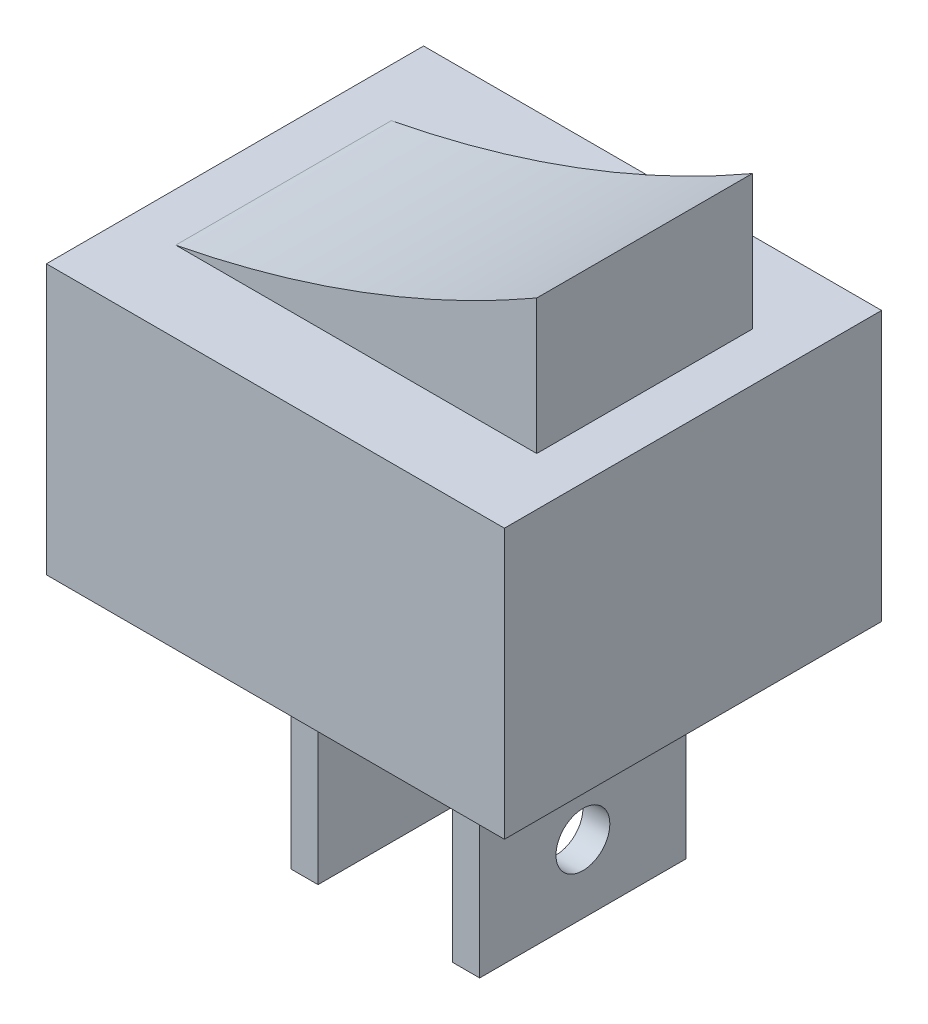
ISO-10303-21;
HEADER;
FILE_DESCRIPTION(('STEP AP214'),'2;1');
FILE_NAME('part.step','',(''),(''),'','','');
FILE_SCHEMA(('AUTOMOTIVE_DESIGN { 1 0 10303 214 1 1 1 1 }'));
ENDSEC;
DATA;
#1=APPLICATION_CONTEXT('core data for automotive mechanical design processes');
#2=APPLICATION_PROTOCOL_DEFINITION('international standard','automotive_design',2000,#1);
#3=PRODUCT_CONTEXT('',#1,'mechanical');
#4=PRODUCT('Part','Part','',(#3));
#5=PRODUCT_RELATED_PRODUCT_CATEGORY('part','',(#4));
#6=PRODUCT_DEFINITION_FORMATION('','',#4);
#7=PRODUCT_DEFINITION_CONTEXT('part definition',#1,'design');
#8=PRODUCT_DEFINITION('design','',#6,#7);
#9=PRODUCT_DEFINITION_SHAPE('','',#8);
#10=(LENGTH_UNIT() NAMED_UNIT(*) SI_UNIT(.MILLI.,.METRE.));
#11=(NAMED_UNIT(*) PLANE_ANGLE_UNIT() SI_UNIT($,.RADIAN.));
#12=(NAMED_UNIT(*) SI_UNIT($,.STERADIAN.) SOLID_ANGLE_UNIT());
#13=UNCERTAINTY_MEASURE_WITH_UNIT(LENGTH_MEASURE(1.E-05),#10,'distance_accuracy_value','');
#14=(GEOMETRIC_REPRESENTATION_CONTEXT(3) GLOBAL_UNCERTAINTY_ASSIGNED_CONTEXT((#13)) GLOBAL_UNIT_ASSIGNED_CONTEXT((#10,
#11,#12)) REPRESENTATION_CONTEXT('',''));
#15=CARTESIAN_POINT('',(0.,0.,0.));
#16=DIRECTION('',(0.,0.,1.));
#17=DIRECTION('',(1.,0.,0.));
#18=AXIS2_PLACEMENT_3D('',#15,#16,#17);
#19=CARTESIAN_POINT('',(0.,0.,0.));
#20=DIRECTION('',(0.,-1.,0.));
#21=DIRECTION('',(0.,0.,-1.));
#22=AXIS2_PLACEMENT_3D('',#19,#20,#21);
#23=PLANE('',#22);
#24=DIRECTION('',(0.,0.,1.));
#25=VECTOR('',#24,1.);
#26=CARTESIAN_POINT('',(0.,0.,0.));
#27=LINE('',#26,#25);
#28=CARTESIAN_POINT('',(0.,0.,-14.));
#29=VERTEX_POINT('',#28);
#30=CARTESIAN_POINT('',(0.,0.,0.));
#31=VERTEX_POINT('',#30);
#32=EDGE_CURVE('E224',#29,#31,#27,.T.);
#33=ORIENTED_EDGE('',*,*,#32,.F.);
#34=DIRECTION('',(-1.,0.,0.));
#35=VECTOR('',#34,1.);
#36=CARTESIAN_POINT('',(0.,0.,-14.));
#37=LINE('',#36,#35);
#38=CARTESIAN_POINT('',(17.,0.,-14.));
#39=VERTEX_POINT('',#38);
#40=EDGE_CURVE('E229',#39,#29,#37,.T.);
#41=ORIENTED_EDGE('',*,*,#40,.F.);
#42=DIRECTION('',(0.,0.,-1.));
#43=VECTOR('',#42,1.);
#44=CARTESIAN_POINT('',(17.,0.,0.));
#45=LINE('',#44,#43);
#46=CARTESIAN_POINT('',(17.,0.,0.));
#47=VERTEX_POINT('',#46);
#48=EDGE_CURVE('E240',#47,#39,#45,.T.);
#49=ORIENTED_EDGE('',*,*,#48,.F.);
#50=DIRECTION('',(1.,0.,0.));
#51=VECTOR('',#50,1.);
#52=CARTESIAN_POINT('',(0.,0.,0.));
#53=LINE('',#52,#51);
#54=EDGE_CURVE('E238',#31,#47,#53,.T.);
#55=ORIENTED_EDGE('',*,*,#54,.F.);
#56=EDGE_LOOP('',(#33,#41,#49,#55));
#57=FACE_BOUND('',#56,.T.);
#58=DIRECTION('',(1.,0.,0.));
#59=VECTOR('',#58,1.);
#60=CARTESIAN_POINT('',(6.,0.,-10.7449701783283));
#61=LINE('',#60,#59);
#62=CARTESIAN_POINT('',(6.,0.,-10.7449701783283));
#63=VERTEX_POINT('',#62);
#64=CARTESIAN_POINT('',(7.,0.,-10.7449701783283));
#65=VERTEX_POINT('',#64);
#66=EDGE_CURVE('E169',#63,#65,#61,.T.);
#67=ORIENTED_EDGE('',*,*,#66,.F.);
#68=DIRECTION('',(0.,0.,-1.));
#69=VECTOR('',#68,1.);
#70=CARTESIAN_POINT('',(6.,0.,-3.08174071316286));
#71=LINE('',#70,#69);
#72=CARTESIAN_POINT('',(6.,0.,-3.08174071316286));
#73=VERTEX_POINT('',#72);
#74=EDGE_CURVE('E166',#73,#63,#71,.T.);
#75=ORIENTED_EDGE('',*,*,#74,.F.);
#76=DIRECTION('',(-1.,0.,0.));
#77=VECTOR('',#76,1.);
#78=CARTESIAN_POINT('',(6.,0.,-3.08174071316286));
#79=LINE('',#78,#77);
#80=CARTESIAN_POINT('',(7.,0.,-3.08174071316286));
#81=VERTEX_POINT('',#80);
#82=EDGE_CURVE('E178',#81,#73,#79,.T.);
#83=ORIENTED_EDGE('',*,*,#82,.F.);
#84=DIRECTION('',(0.,0.,1.));
#85=VECTOR('',#84,1.);
#86=CARTESIAN_POINT('',(7.,0.,-3.08174071316286));
#87=LINE('',#86,#85);
#88=EDGE_CURVE('E186',#65,#81,#87,.T.);
#89=ORIENTED_EDGE('',*,*,#88,.F.);
#90=EDGE_LOOP('',(#67,#75,#83,#89));
#91=FACE_BOUND('',#90,.T.);
#92=DIRECTION('',(1.,0.,0.));
#93=VECTOR('',#92,1.);
#94=CARTESIAN_POINT('',(12.,0.,-10.7449701783283));
#95=LINE('',#94,#93);
#96=CARTESIAN_POINT('',(12.,0.,-10.7449701783283));
#97=VERTEX_POINT('',#96);
#98=CARTESIAN_POINT('',(13.,0.,-10.7449701783283));
#99=VERTEX_POINT('',#98);
#100=EDGE_CURVE('E379',#97,#99,#95,.T.);
#101=ORIENTED_EDGE('',*,*,#100,.F.);
#102=DIRECTION('',(0.,0.,-1.));
#103=VECTOR('',#102,1.);
#104=CARTESIAN_POINT('',(12.,0.,-3.08174071316286));
#105=LINE('',#104,#103);
#106=CARTESIAN_POINT('',(12.,0.,-3.08174071316286));
#107=VERTEX_POINT('',#106);
#108=EDGE_CURVE('E164',#107,#97,#105,.T.);
#109=ORIENTED_EDGE('',*,*,#108,.F.);
#110=DIRECTION('',(-1.,0.,0.));
#111=VECTOR('',#110,1.);
#112=CARTESIAN_POINT('',(12.,0.,-3.08174071316286));
#113=LINE('',#112,#111);
#114=CARTESIAN_POINT('',(13.,0.,-3.08174071316286));
#115=VERTEX_POINT('',#114);
#116=EDGE_CURVE('E160',#115,#107,#113,.T.);
#117=ORIENTED_EDGE('',*,*,#116,.F.);
#118=DIRECTION('',(0.,0.,1.));
#119=VECTOR('',#118,1.);
#120=CARTESIAN_POINT('',(13.,0.,-3.08174071316286));
#121=LINE('',#120,#119);
#122=EDGE_CURVE('E381',#99,#115,#121,.T.);
#123=ORIENTED_EDGE('',*,*,#122,.F.);
#124=EDGE_LOOP('',(#101,#109,#117,#123));
#125=FACE_BOUND('',#124,.T.);
#126=ADVANCED_FACE('F33',(#57,#91,#125),#23,.T.);
#127=CARTESIAN_POINT('',(1.8,15.,-3.));
#128=DIRECTION('',(0.,0.,-1.));
#129=DIRECTION('',(-1.,0.,0.));
#130=AXIS2_PLACEMENT_3D('',#127,#128,#129);
#131=PLANE('',#130);
#132=CARTESIAN_POINT('',(-6.37692511685268,52.3701593131652,-3.));
#133=DIRECTION('',(0.,0.,-1.));
#134=DIRECTION('',(-1.,0.,0.));
#135=AXIS2_PLACEMENT_3D('',#132,#133,#134);
#136=CIRCLE('',#135,43.1519698807553);
#137=CARTESIAN_POINT('',(1.8,10.,-3.));
#138=VERTEX_POINT('',#137);
#139=CARTESIAN_POINT('',(15.2,15.,-3.));
#140=VERTEX_POINT('',#139);
#141=EDGE_CURVE('E200',#138,#140,#136,.F.);
#142=ORIENTED_EDGE('',*,*,#141,.F.);
#143=DIRECTION('',(1.,0.,0.));
#144=VECTOR('',#143,1.);
#145=CARTESIAN_POINT('',(1.8,10.,-3.));
#146=LINE('',#145,#144);
#147=CARTESIAN_POINT('',(15.2,10.,-3.));
#148=VERTEX_POINT('',#147);
#149=EDGE_CURVE('E211',#138,#148,#146,.T.);
#150=ORIENTED_EDGE('',*,*,#149,.T.);
#151=DIRECTION('',(0.,-1.,0.));
#152=VECTOR('',#151,1.);
#153=CARTESIAN_POINT('',(15.2,15.,-3.));
#154=LINE('',#153,#152);
#155=EDGE_CURVE('E221',#140,#148,#154,.T.);
#156=ORIENTED_EDGE('',*,*,#155,.F.);
#157=EDGE_LOOP('',(#142,#150,#156));
#158=FACE_BOUND('',#157,.T.);
#159=ADVANCED_FACE('F276',(#158),#131,.F.);
#160=CARTESIAN_POINT('',(1.8,15.,-11.));
#161=DIRECTION('',(0.,0.,1.));
#162=DIRECTION('',(1.,0.,0.));
#163=AXIS2_PLACEMENT_3D('',#160,#161,#162);
#164=PLANE('',#163);
#165=CARTESIAN_POINT('',(-6.37692511685268,52.3701593131652,-11.));
#166=DIRECTION('',(0.,0.,1.));
#167=DIRECTION('',(1.,0.,0.));
#168=AXIS2_PLACEMENT_3D('',#165,#166,#167);
#169=CIRCLE('',#168,43.1519698807553);
#170=CARTESIAN_POINT('',(15.2,15.,-11.));
#171=VERTEX_POINT('',#170);
#172=CARTESIAN_POINT('',(1.8,10.,-11.));
#173=VERTEX_POINT('',#172);
#174=EDGE_CURVE('E197',#171,#173,#169,.F.);
#175=ORIENTED_EDGE('',*,*,#174,.F.);
#176=DIRECTION('',(0.,-1.,0.));
#177=VECTOR('',#176,1.);
#178=CARTESIAN_POINT('',(15.2,15.,-11.));
#179=LINE('',#178,#177);
#180=CARTESIAN_POINT('',(15.2,10.,-11.));
#181=VERTEX_POINT('',#180);
#182=EDGE_CURVE('E207',#171,#181,#179,.T.);
#183=ORIENTED_EDGE('',*,*,#182,.T.);
#184=DIRECTION('',(-1.,0.,0.));
#185=VECTOR('',#184,1.);
#186=CARTESIAN_POINT('',(1.8,10.,-11.));
#187=LINE('',#186,#185);
#188=EDGE_CURVE('E208',#181,#173,#187,.T.);
#189=ORIENTED_EDGE('',*,*,#188,.T.);
#190=EDGE_LOOP('',(#175,#183,#189));
#191=FACE_BOUND('',#190,.T.);
#192=ADVANCED_FACE('F281',(#191),#164,.F.);
#193=CARTESIAN_POINT('',(0.,10.,0.));
#194=DIRECTION('',(0.,-1.,0.));
#195=DIRECTION('',(0.,0.,-1.));
#196=AXIS2_PLACEMENT_3D('',#193,#194,#195);
#197=PLANE('',#196);
#198=ORIENTED_EDGE('',*,*,#149,.F.);
#199=DIRECTION('',(0.,0.,1.));
#200=VECTOR('',#199,1.);
#201=CARTESIAN_POINT('',(1.8,10.,-11.));
#202=LINE('',#201,#200);
#203=EDGE_CURVE('E203',#173,#138,#202,.T.);
#204=ORIENTED_EDGE('',*,*,#203,.F.);
#205=ORIENTED_EDGE('',*,*,#188,.F.);
#206=DIRECTION('',(0.,0.,-1.));
#207=VECTOR('',#206,1.);
#208=CARTESIAN_POINT('',(15.2,10.,-11.));
#209=LINE('',#208,#207);
#210=EDGE_CURVE('E214',#148,#181,#209,.T.);
#211=ORIENTED_EDGE('',*,*,#210,.F.);
#212=EDGE_LOOP('',(#198,#204,#205,#211));
#213=FACE_BOUND('',#212,.T.);
#214=DIRECTION('',(1.,0.,0.));
#215=VECTOR('',#214,1.);
#216=CARTESIAN_POINT('',(0.,10.,0.));
#217=LINE('',#216,#215);
#218=CARTESIAN_POINT('',(0.,10.,0.));
#219=VERTEX_POINT('',#218);
#220=CARTESIAN_POINT('',(17.,10.,0.));
#221=VERTEX_POINT('',#220);
#222=EDGE_CURVE('E228',#219,#221,#217,.T.);
#223=ORIENTED_EDGE('',*,*,#222,.T.);
#224=DIRECTION('',(0.,0.,-1.));
#225=VECTOR('',#224,1.);
#226=CARTESIAN_POINT('',(17.,10.,0.));
#227=LINE('',#226,#225);
#228=CARTESIAN_POINT('',(17.,10.,-14.));
#229=VERTEX_POINT('',#228);
#230=EDGE_CURVE('E231',#221,#229,#227,.T.);
#231=ORIENTED_EDGE('',*,*,#230,.T.);
#232=DIRECTION('',(-1.,0.,0.));
#233=VECTOR('',#232,1.);
#234=CARTESIAN_POINT('',(0.,10.,-14.));
#235=LINE('',#234,#233);
#236=CARTESIAN_POINT('',(0.,10.,-14.));
#237=VERTEX_POINT('',#236);
#238=EDGE_CURVE('E233',#229,#237,#235,.T.);
#239=ORIENTED_EDGE('',*,*,#238,.T.);
#240=DIRECTION('',(0.,0.,1.));
#241=VECTOR('',#240,1.);
#242=CARTESIAN_POINT('',(0.,10.,0.));
#243=LINE('',#242,#241);
#244=EDGE_CURVE('E225',#237,#219,#243,.T.);
#245=ORIENTED_EDGE('',*,*,#244,.T.);
#246=EDGE_LOOP('',(#223,#231,#239,#245));
#247=FACE_BOUND('',#246,.T.);
#248=ADVANCED_FACE('F267',(#213,#247),#197,.F.);
#249=CARTESIAN_POINT('',(0.,10.,0.));
#250=DIRECTION('',(1.,0.,0.));
#251=DIRECTION('',(0.,0.,-1.));
#252=AXIS2_PLACEMENT_3D('',#249,#250,#251);
#253=PLANE('',#252);
#254=ORIENTED_EDGE('',*,*,#32,.T.);
#255=DIRECTION('',(0.,-1.,0.));
#256=VECTOR('',#255,1.);
#257=CARTESIAN_POINT('',(0.,10.,0.));
#258=LINE('',#257,#256);
#259=EDGE_CURVE('E11',#219,#31,#258,.T.);
#260=ORIENTED_EDGE('',*,*,#259,.F.);
#261=ORIENTED_EDGE('',*,*,#244,.F.);
#262=DIRECTION('',(0.,-1.,0.));
#263=VECTOR('',#262,1.);
#264=CARTESIAN_POINT('',(0.,10.,-14.));
#265=LINE('',#264,#263);
#266=EDGE_CURVE('E235',#237,#29,#265,.T.);
#267=ORIENTED_EDGE('',*,*,#266,.T.);
#268=EDGE_LOOP('',(#254,#260,#261,#267));
#269=FACE_BOUND('',#268,.T.);
#270=ADVANCED_FACE('F35',(#269),#253,.F.);
#271=CARTESIAN_POINT('',(0.,10.,0.));
#272=DIRECTION('',(0.,0.,-1.));
#273=DIRECTION('',(-1.,0.,0.));
#274=AXIS2_PLACEMENT_3D('',#271,#272,#273);
#275=PLANE('',#274);
#276=ORIENTED_EDGE('',*,*,#54,.T.);
#277=DIRECTION('',(0.,-1.,0.));
#278=VECTOR('',#277,1.);
#279=CARTESIAN_POINT('',(17.,10.,0.));
#280=LINE('',#279,#278);
#281=EDGE_CURVE('E41',#221,#47,#280,.T.);
#282=ORIENTED_EDGE('',*,*,#281,.F.);
#283=ORIENTED_EDGE('',*,*,#222,.F.);
#284=ORIENTED_EDGE('',*,*,#259,.T.);
#285=EDGE_LOOP('',(#276,#282,#283,#284));
#286=FACE_BOUND('',#285,.T.);
#287=ADVANCED_FACE('F268',(#286),#275,.F.);
#288=CARTESIAN_POINT('',(17.,10.,0.));
#289=DIRECTION('',(-1.,0.,0.));
#290=DIRECTION('',(0.,0.,1.));
#291=AXIS2_PLACEMENT_3D('',#288,#289,#290);
#292=PLANE('',#291);
#293=ORIENTED_EDGE('',*,*,#48,.T.);
#294=DIRECTION('',(0.,-1.,0.));
#295=VECTOR('',#294,1.);
#296=CARTESIAN_POINT('',(17.,10.,-14.));
#297=LINE('',#296,#295);
#298=EDGE_CURVE('E245',#229,#39,#297,.T.);
#299=ORIENTED_EDGE('',*,*,#298,.F.);
#300=ORIENTED_EDGE('',*,*,#230,.F.);
#301=ORIENTED_EDGE('',*,*,#281,.T.);
#302=EDGE_LOOP('',(#293,#299,#300,#301));
#303=FACE_BOUND('',#302,.T.);
#304=ADVANCED_FACE('F252',(#303),#292,.F.);
#305=CARTESIAN_POINT('',(0.,10.,-14.));
#306=DIRECTION('',(0.,0.,1.));
#307=DIRECTION('',(1.,0.,0.));
#308=AXIS2_PLACEMENT_3D('',#305,#306,#307);
#309=PLANE('',#308);
#310=ORIENTED_EDGE('',*,*,#40,.T.);
#311=ORIENTED_EDGE('',*,*,#266,.F.);
#312=ORIENTED_EDGE('',*,*,#238,.F.);
#313=ORIENTED_EDGE('',*,*,#298,.T.);
#314=EDGE_LOOP('',(#310,#311,#312,#313));
#315=FACE_BOUND('',#314,.T.);
#316=ADVANCED_FACE('F261',(#315),#309,.F.);
#317=CARTESIAN_POINT('',(15.2,15.,-11.));
#318=DIRECTION('',(-1.,0.,0.));
#319=DIRECTION('',(0.,0.,1.));
#320=AXIS2_PLACEMENT_3D('',#317,#318,#319);
#321=PLANE('',#320);
#322=ORIENTED_EDGE('',*,*,#210,.T.);
#323=ORIENTED_EDGE('',*,*,#182,.F.);
#324=DIRECTION('',(0.,0.,-1.));
#325=VECTOR('',#324,1.);
#326=CARTESIAN_POINT('',(15.2,15.,-11.));
#327=LINE('',#326,#325);
#328=EDGE_CURVE('E204',#140,#171,#327,.T.);
#329=ORIENTED_EDGE('',*,*,#328,.F.);
#330=ORIENTED_EDGE('',*,*,#155,.T.);
#331=EDGE_LOOP('',(#322,#323,#329,#330));
#332=FACE_BOUND('',#331,.T.);
#333=ADVANCED_FACE('F287',(#332),#321,.F.);
#334=CARTESIAN_POINT('',(-6.37692511685268,52.3701593131652,-40.0572814861856));
#335=DIRECTION('',(0.,0.,1.));
#336=DIRECTION('',(1.,0.,0.));
#337=AXIS2_PLACEMENT_3D('',#334,#335,#336);
#338=CYLINDRICAL_SURFACE('',#337,43.1519698807553);
#339=ORIENTED_EDGE('',*,*,#203,.T.);
#340=ORIENTED_EDGE('',*,*,#141,.T.);
#341=ORIENTED_EDGE('',*,*,#328,.T.);
#342=ORIENTED_EDGE('',*,*,#174,.T.);
#343=EDGE_LOOP('',(#339,#340,#341,#342));
#344=FACE_BOUND('',#343,.T.);
#345=ADVANCED_FACE('F291',(#344),#338,.F.);
#346=CARTESIAN_POINT('',(6.,-8.,-3.08174071316286));
#347=DIRECTION('',(1.,0.,0.));
#348=DIRECTION('',(0.,0.,-1.));
#349=AXIS2_PLACEMENT_3D('',#346,#347,#348);
#350=PLANE('',#349);
#351=CARTESIAN_POINT('',(6.,-1.86747044158864,-6.91335544574559));
#352=DIRECTION('',(1.,0.,0.));
#353=DIRECTION('',(0.,0.,-1.));
#354=AXIS2_PLACEMENT_3D('',#351,#352,#353);
#355=CIRCLE('',#354,1.);
#356=CARTESIAN_POINT('',(6.,-1.86747044158864,-7.91335544574559));
#357=VERTEX_POINT('',#356);
#358=EDGE_CURVE('E366',#357,#357,#355,.T.);
#359=ORIENTED_EDGE('',*,*,#358,.T.);
#360=EDGE_LOOP('',(#359));
#361=FACE_BOUND('',#360,.T.);
#362=CARTESIAN_POINT('',(6.,-5.46418983792485,-6.91335544574559));
#363=DIRECTION('',(1.,0.,0.));
#364=DIRECTION('',(0.,0.,-1.));
#365=AXIS2_PLACEMENT_3D('',#362,#363,#364);
#366=CIRCLE('',#365,1.);
#367=CARTESIAN_POINT('',(6.,-5.46418983792485,-7.91335544574559));
#368=VERTEX_POINT('',#367);
#369=EDGE_CURVE('E363',#368,#368,#366,.T.);
#370=ORIENTED_EDGE('',*,*,#369,.T.);
#371=EDGE_LOOP('',(#370));
#372=FACE_BOUND('',#371,.T.);
#373=ORIENTED_EDGE('',*,*,#74,.T.);
#374=DIRECTION('',(0.,1.,0.));
#375=VECTOR('',#374,1.);
#376=CARTESIAN_POINT('',(6.,-8.,-10.7449701783283));
#377=LINE('',#376,#375);
#378=CARTESIAN_POINT('',(6.,-8.,-10.7449701783283));
#379=VERTEX_POINT('',#378);
#380=EDGE_CURVE('E195',#379,#63,#377,.T.);
#381=ORIENTED_EDGE('',*,*,#380,.F.);
#382=DIRECTION('',(0.,0.,-1.));
#383=VECTOR('',#382,1.);
#384=CARTESIAN_POINT('',(6.,-8.,-3.08174071316286));
#385=LINE('',#384,#383);
#386=CARTESIAN_POINT('',(6.,-8.,-3.08174071316286));
#387=VERTEX_POINT('',#386);
#388=EDGE_CURVE('E174',#387,#379,#385,.T.);
#389=ORIENTED_EDGE('',*,*,#388,.F.);
#390=DIRECTION('',(0.,1.,0.));
#391=VECTOR('',#390,1.);
#392=CARTESIAN_POINT('',(6.,-8.,-3.08174071316286));
#393=LINE('',#392,#391);
#394=EDGE_CURVE('E183',#387,#73,#393,.T.);
#395=ORIENTED_EDGE('',*,*,#394,.T.);
#396=EDGE_LOOP('',(#373,#381,#389,#395));
#397=FACE_BOUND('',#396,.T.);
#398=ADVANCED_FACE('F297',(#361,#372,#397),#350,.F.);
#399=CARTESIAN_POINT('',(6.,-8.,-10.7449701783283));
#400=DIRECTION('',(0.,0.,1.));
#401=DIRECTION('',(1.,0.,0.));
#402=AXIS2_PLACEMENT_3D('',#399,#400,#401);
#403=PLANE('',#402);
#404=ORIENTED_EDGE('',*,*,#66,.T.);
#405=DIRECTION('',(0.,1.,0.));
#406=VECTOR('',#405,1.);
#407=CARTESIAN_POINT('',(7.,-8.,-10.7449701783283));
#408=LINE('',#407,#406);
#409=CARTESIAN_POINT('',(7.,-8.,-10.7449701783283));
#410=VERTEX_POINT('',#409);
#411=EDGE_CURVE('E192',#410,#65,#408,.T.);
#412=ORIENTED_EDGE('',*,*,#411,.F.);
#413=DIRECTION('',(1.,0.,0.));
#414=VECTOR('',#413,1.);
#415=CARTESIAN_POINT('',(6.,-8.,-10.7449701783283));
#416=LINE('',#415,#414);
#417=EDGE_CURVE('E177',#379,#410,#416,.T.);
#418=ORIENTED_EDGE('',*,*,#417,.F.);
#419=ORIENTED_EDGE('',*,*,#380,.T.);
#420=EDGE_LOOP('',(#404,#412,#418,#419));
#421=FACE_BOUND('',#420,.T.);
#422=ADVANCED_FACE('F306',(#421),#403,.F.);
#423=CARTESIAN_POINT('',(7.,-8.,-3.08174071316286));
#424=DIRECTION('',(-1.,0.,0.));
#425=DIRECTION('',(0.,0.,1.));
#426=AXIS2_PLACEMENT_3D('',#423,#424,#425);
#427=PLANE('',#426);
#428=CARTESIAN_POINT('',(7.,-1.86747044158864,-6.91335544574559));
#429=DIRECTION('',(-1.,0.,0.));
#430=DIRECTION('',(0.,0.,1.));
#431=AXIS2_PLACEMENT_3D('',#428,#429,#430);
#432=CIRCLE('',#431,1.);
#433=CARTESIAN_POINT('',(7.,-1.86747044158864,-5.91335544574559));
#434=VERTEX_POINT('',#433);
#435=EDGE_CURVE('E362',#434,#434,#432,.T.);
#436=ORIENTED_EDGE('',*,*,#435,.T.);
#437=EDGE_LOOP('',(#436));
#438=FACE_BOUND('',#437,.T.);
#439=CARTESIAN_POINT('',(7.,-5.46418983792485,-6.91335544574559));
#440=DIRECTION('',(-1.,0.,0.));
#441=DIRECTION('',(0.,0.,1.));
#442=AXIS2_PLACEMENT_3D('',#439,#440,#441);
#443=CIRCLE('',#442,1.);
#444=CARTESIAN_POINT('',(7.,-5.46418983792485,-5.91335544574559));
#445=VERTEX_POINT('',#444);
#446=EDGE_CURVE('E369',#445,#445,#443,.T.);
#447=ORIENTED_EDGE('',*,*,#446,.T.);
#448=EDGE_LOOP('',(#447));
#449=FACE_BOUND('',#448,.T.);
#450=ORIENTED_EDGE('',*,*,#88,.T.);
#451=DIRECTION('',(0.,1.,0.));
#452=VECTOR('',#451,1.);
#453=CARTESIAN_POINT('',(7.,-8.,-3.08174071316286));
#454=LINE('',#453,#452);
#455=CARTESIAN_POINT('',(7.,-8.,-3.08174071316286));
#456=VERTEX_POINT('',#455);
#457=EDGE_CURVE('E56',#456,#81,#454,.T.);
#458=ORIENTED_EDGE('',*,*,#457,.F.);
#459=DIRECTION('',(0.,0.,1.));
#460=VECTOR('',#459,1.);
#461=CARTESIAN_POINT('',(7.,-8.,-3.08174071316286));
#462=LINE('',#461,#460);
#463=EDGE_CURVE('E180',#410,#456,#462,.T.);
#464=ORIENTED_EDGE('',*,*,#463,.F.);
#465=ORIENTED_EDGE('',*,*,#411,.T.);
#466=EDGE_LOOP('',(#450,#458,#464,#465));
#467=FACE_BOUND('',#466,.T.);
#468=ADVANCED_FACE('F310',(#438,#449,#467),#427,.F.);
#469=CARTESIAN_POINT('',(6.,-8.,-3.08174071316286));
#470=DIRECTION('',(0.,0.,-1.));
#471=DIRECTION('',(-1.,0.,0.));
#472=AXIS2_PLACEMENT_3D('',#469,#470,#471);
#473=PLANE('',#472);
#474=ORIENTED_EDGE('',*,*,#82,.T.);
#475=ORIENTED_EDGE('',*,*,#394,.F.);
#476=DIRECTION('',(-1.,0.,0.));
#477=VECTOR('',#476,1.);
#478=CARTESIAN_POINT('',(6.,-8.,-3.08174071316286));
#479=LINE('',#478,#477);
#480=EDGE_CURVE('E182',#456,#387,#479,.T.);
#481=ORIENTED_EDGE('',*,*,#480,.F.);
#482=ORIENTED_EDGE('',*,*,#457,.T.);
#483=EDGE_LOOP('',(#474,#475,#481,#482));
#484=FACE_BOUND('',#483,.T.);
#485=ADVANCED_FACE('F314',(#484),#473,.F.);
#486=CARTESIAN_POINT('',(0.,-8.,0.));
#487=DIRECTION('',(0.,-1.,0.));
#488=DIRECTION('',(0.,0.,-1.));
#489=AXIS2_PLACEMENT_3D('',#486,#487,#488);
#490=PLANE('',#489);
#491=ORIENTED_EDGE('',*,*,#388,.T.);
#492=ORIENTED_EDGE('',*,*,#417,.T.);
#493=ORIENTED_EDGE('',*,*,#463,.T.);
#494=ORIENTED_EDGE('',*,*,#480,.T.);
#495=EDGE_LOOP('',(#491,#492,#493,#494));
#496=FACE_BOUND('',#495,.T.);
#497=ADVANCED_FACE('F318',(#496),#490,.T.);
#498=CARTESIAN_POINT('',(12.,-8.,-3.08174071316286));
#499=DIRECTION('',(1.,0.,0.));
#500=DIRECTION('',(0.,0.,-1.));
#501=AXIS2_PLACEMENT_3D('',#498,#499,#500);
#502=PLANE('',#501);
#503=CARTESIAN_POINT('',(12.,-1.86747044158864,-6.91335544574559));
#504=DIRECTION('',(1.,0.,0.));
#505=DIRECTION('',(0.,0.,-1.));
#506=AXIS2_PLACEMENT_3D('',#503,#504,#505);
#507=CIRCLE('',#506,1.);
#508=CARTESIAN_POINT('',(12.,-1.86747044158864,-7.91335544574559));
#509=VERTEX_POINT('',#508);
#510=EDGE_CURVE('E361',#509,#509,#507,.T.);
#511=ORIENTED_EDGE('',*,*,#510,.T.);
#512=EDGE_LOOP('',(#511));
#513=FACE_BOUND('',#512,.T.);
#514=CARTESIAN_POINT('',(12.,-5.46418983792485,-6.91335544574559));
#515=DIRECTION('',(1.,0.,0.));
#516=DIRECTION('',(0.,0.,-1.));
#517=AXIS2_PLACEMENT_3D('',#514,#515,#516);
#518=CIRCLE('',#517,1.);
#519=CARTESIAN_POINT('',(12.,-5.46418983792485,-7.91335544574559));
#520=VERTEX_POINT('',#519);
#521=EDGE_CURVE('E405',#520,#520,#518,.T.);
#522=ORIENTED_EDGE('',*,*,#521,.T.);
#523=EDGE_LOOP('',(#522));
#524=FACE_BOUND('',#523,.T.);
#525=ORIENTED_EDGE('',*,*,#108,.T.);
#526=DIRECTION('',(0.,1.,0.));
#527=VECTOR('',#526,1.);
#528=CARTESIAN_POINT('',(12.,-8.,-10.7449701783283));
#529=LINE('',#528,#527);
#530=CARTESIAN_POINT('',(12.,-8.,-10.7449701783283));
#531=VERTEX_POINT('',#530);
#532=EDGE_CURVE('E145',#531,#97,#529,.T.);
#533=ORIENTED_EDGE('',*,*,#532,.F.);
#534=DIRECTION('',(0.,0.,-1.));
#535=VECTOR('',#534,1.);
#536=CARTESIAN_POINT('',(12.,-8.,-3.08174071316286));
#537=LINE('',#536,#535);
#538=CARTESIAN_POINT('',(12.,-8.,-3.08174071316286));
#539=VERTEX_POINT('',#538);
#540=EDGE_CURVE('E152',#539,#531,#537,.T.);
#541=ORIENTED_EDGE('',*,*,#540,.F.);
#542=DIRECTION('',(0.,1.,0.));
#543=VECTOR('',#542,1.);
#544=CARTESIAN_POINT('',(12.,-8.,-3.08174071316286));
#545=LINE('',#544,#543);
#546=EDGE_CURVE('E377',#539,#107,#545,.T.);
#547=ORIENTED_EDGE('',*,*,#546,.T.);
#548=EDGE_LOOP('',(#525,#533,#541,#547));
#549=FACE_BOUND('',#548,.T.);
#550=ADVANCED_FACE('F162',(#513,#524,#549),#502,.F.);
#551=CARTESIAN_POINT('',(12.,-8.,-10.7449701783283));
#552=DIRECTION('',(0.,0.,1.));
#553=DIRECTION('',(1.,0.,0.));
#554=AXIS2_PLACEMENT_3D('',#551,#552,#553);
#555=PLANE('',#554);
#556=ORIENTED_EDGE('',*,*,#100,.T.);
#557=DIRECTION('',(0.,1.,0.));
#558=VECTOR('',#557,1.);
#559=CARTESIAN_POINT('',(13.,-8.,-10.7449701783283));
#560=LINE('',#559,#558);
#561=CARTESIAN_POINT('',(13.,-8.,-10.7449701783283));
#562=VERTEX_POINT('',#561);
#563=EDGE_CURVE('E148',#562,#99,#560,.T.);
#564=ORIENTED_EDGE('',*,*,#563,.F.);
#565=DIRECTION('',(1.,0.,0.));
#566=VECTOR('',#565,1.);
#567=CARTESIAN_POINT('',(12.,-8.,-10.7449701783283));
#568=LINE('',#567,#566);
#569=EDGE_CURVE('E141',#531,#562,#568,.T.);
#570=ORIENTED_EDGE('',*,*,#569,.F.);
#571=ORIENTED_EDGE('',*,*,#532,.T.);
#572=EDGE_LOOP('',(#556,#564,#570,#571));
#573=FACE_BOUND('',#572,.T.);
#574=ADVANCED_FACE('F143',(#573),#555,.F.);
#575=CARTESIAN_POINT('',(13.,-8.,-3.08174071316286));
#576=DIRECTION('',(-1.,0.,0.));
#577=DIRECTION('',(0.,0.,1.));
#578=AXIS2_PLACEMENT_3D('',#575,#576,#577);
#579=PLANE('',#578);
#580=CARTESIAN_POINT('',(13.,-1.86747044158864,-6.91335544574559));
#581=DIRECTION('',(1.,0.,0.));
#582=DIRECTION('',(0.,0.,-1.));
#583=AXIS2_PLACEMENT_3D('',#580,#581,#582);
#584=CIRCLE('',#583,1.);
#585=CARTESIAN_POINT('',(13.,-1.86747044158864,-7.91335544574559));
#586=VERTEX_POINT('',#585);
#587=EDGE_CURVE('E358',#586,#586,#584,.T.);
#588=ORIENTED_EDGE('',*,*,#587,.F.);
#589=EDGE_LOOP('',(#588));
#590=FACE_BOUND('',#589,.T.);
#591=CARTESIAN_POINT('',(13.,-5.46418983792485,-6.91335544574559));
#592=DIRECTION('',(1.,0.,0.));
#593=DIRECTION('',(0.,0.,-1.));
#594=AXIS2_PLACEMENT_3D('',#591,#592,#593);
#595=CIRCLE('',#594,1.);
#596=CARTESIAN_POINT('',(13.,-5.46418983792485,-7.91335544574559));
#597=VERTEX_POINT('',#596);
#598=EDGE_CURVE('E408',#597,#597,#595,.T.);
#599=ORIENTED_EDGE('',*,*,#598,.F.);
#600=EDGE_LOOP('',(#599));
#601=FACE_BOUND('',#600,.T.);
#602=ORIENTED_EDGE('',*,*,#122,.T.);
#603=DIRECTION('',(0.,1.,0.));
#604=VECTOR('',#603,1.);
#605=CARTESIAN_POINT('',(13.,-8.,-3.08174071316286));
#606=LINE('',#605,#604);
#607=CARTESIAN_POINT('',(13.,-8.,-3.08174071316286));
#608=VERTEX_POINT('',#607);
#609=EDGE_CURVE('E48',#608,#115,#606,.T.);
#610=ORIENTED_EDGE('',*,*,#609,.F.);
#611=DIRECTION('',(0.,0.,1.));
#612=VECTOR('',#611,1.);
#613=CARTESIAN_POINT('',(13.,-8.,-3.08174071316286));
#614=LINE('',#613,#612);
#615=EDGE_CURVE('E151',#562,#608,#614,.T.);
#616=ORIENTED_EDGE('',*,*,#615,.F.);
#617=ORIENTED_EDGE('',*,*,#563,.T.);
#618=EDGE_LOOP('',(#602,#610,#616,#617));
#619=FACE_BOUND('',#618,.T.);
#620=ADVANCED_FACE('F327',(#590,#601,#619),#579,.F.);
#621=CARTESIAN_POINT('',(12.,-8.,-3.08174071316286));
#622=DIRECTION('',(0.,0.,-1.));
#623=DIRECTION('',(-1.,0.,0.));
#624=AXIS2_PLACEMENT_3D('',#621,#622,#623);
#625=PLANE('',#624);
#626=ORIENTED_EDGE('',*,*,#116,.T.);
#627=ORIENTED_EDGE('',*,*,#546,.F.);
#628=DIRECTION('',(-1.,0.,0.));
#629=VECTOR('',#628,1.);
#630=CARTESIAN_POINT('',(12.,-8.,-3.08174071316286));
#631=LINE('',#630,#629);
#632=EDGE_CURVE('E156',#608,#539,#631,.T.);
#633=ORIENTED_EDGE('',*,*,#632,.F.);
#634=ORIENTED_EDGE('',*,*,#609,.T.);
#635=EDGE_LOOP('',(#626,#627,#633,#634));
#636=FACE_BOUND('',#635,.T.);
#637=ADVANCED_FACE('F330',(#636),#625,.F.);
#638=CARTESIAN_POINT('',(0.,-8.,0.));
#639=DIRECTION('',(0.,-1.,0.));
#640=DIRECTION('',(0.,0.,-1.));
#641=AXIS2_PLACEMENT_3D('',#638,#639,#640);
#642=PLANE('',#641);
#643=ORIENTED_EDGE('',*,*,#540,.T.);
#644=ORIENTED_EDGE('',*,*,#569,.T.);
#645=ORIENTED_EDGE('',*,*,#615,.T.);
#646=ORIENTED_EDGE('',*,*,#632,.T.);
#647=EDGE_LOOP('',(#643,#644,#645,#646));
#648=FACE_BOUND('',#647,.T.);
#649=ADVANCED_FACE('F155',(#648),#642,.T.);
#650=CARTESIAN_POINT('',(0.,-5.46418983792485,-6.91335544574559));
#651=DIRECTION('',(1.,0.,0.));
#652=DIRECTION('',(0.,0.,-1.));
#653=AXIS2_PLACEMENT_3D('',#650,#651,#652);
#654=CYLINDRICAL_SURFACE('',#653,1.);
#655=ORIENTED_EDGE('',*,*,#598,.T.);
#656=EDGE_LOOP('',(#655));
#657=FACE_BOUND('',#656,.T.);
#658=ORIENTED_EDGE('',*,*,#521,.F.);
#659=EDGE_LOOP('',(#658));
#660=FACE_BOUND('',#659,.T.);
#661=ADVANCED_FACE('F336',(#657,#660),#654,.F.);
#662=CARTESIAN_POINT('',(0.,-1.86747044158864,-6.91335544574559));
#663=DIRECTION('',(1.,0.,0.));
#664=DIRECTION('',(0.,0.,-1.));
#665=AXIS2_PLACEMENT_3D('',#662,#663,#664);
#666=CYLINDRICAL_SURFACE('',#665,1.);
#667=ORIENTED_EDGE('',*,*,#587,.T.);
#668=EDGE_LOOP('',(#667));
#669=FACE_BOUND('',#668,.T.);
#670=ORIENTED_EDGE('',*,*,#510,.F.);
#671=EDGE_LOOP('',(#670));
#672=FACE_BOUND('',#671,.T.);
#673=ADVANCED_FACE('F341',(#669,#672),#666,.F.);
#674=ORIENTED_EDGE('',*,*,#446,.F.);
#675=EDGE_LOOP('',(#674));
#676=FACE_BOUND('',#675,.T.);
#677=ORIENTED_EDGE('',*,*,#369,.F.);
#678=EDGE_LOOP('',(#677));
#679=FACE_BOUND('',#678,.T.);
#680=ADVANCED_FACE('F337',(#676,#679),#654,.F.);
#681=ORIENTED_EDGE('',*,*,#435,.F.);
#682=EDGE_LOOP('',(#681));
#683=FACE_BOUND('',#682,.T.);
#684=ORIENTED_EDGE('',*,*,#358,.F.);
#685=EDGE_LOOP('',(#684));
#686=FACE_BOUND('',#685,.T.);
#687=ADVANCED_FACE('F340',(#683,#686),#666,.F.);
#688=CLOSED_SHELL('',(#126,#159,#192,#248,#270,#287,#304,#316,#333,#345,#398,#422,#468,#485,
#497,#550,#574,#620,#637,#649,#661,#673,#680,#687));
#689=MANIFOLD_SOLID_BREP('B2',#688);
#690=ADVANCED_BREP_SHAPE_REPRESENTATION('',(#18,#689),#14);
#691=SHAPE_DEFINITION_REPRESENTATION(#9,#690);
ENDSEC;
END-ISO-10303-21;
